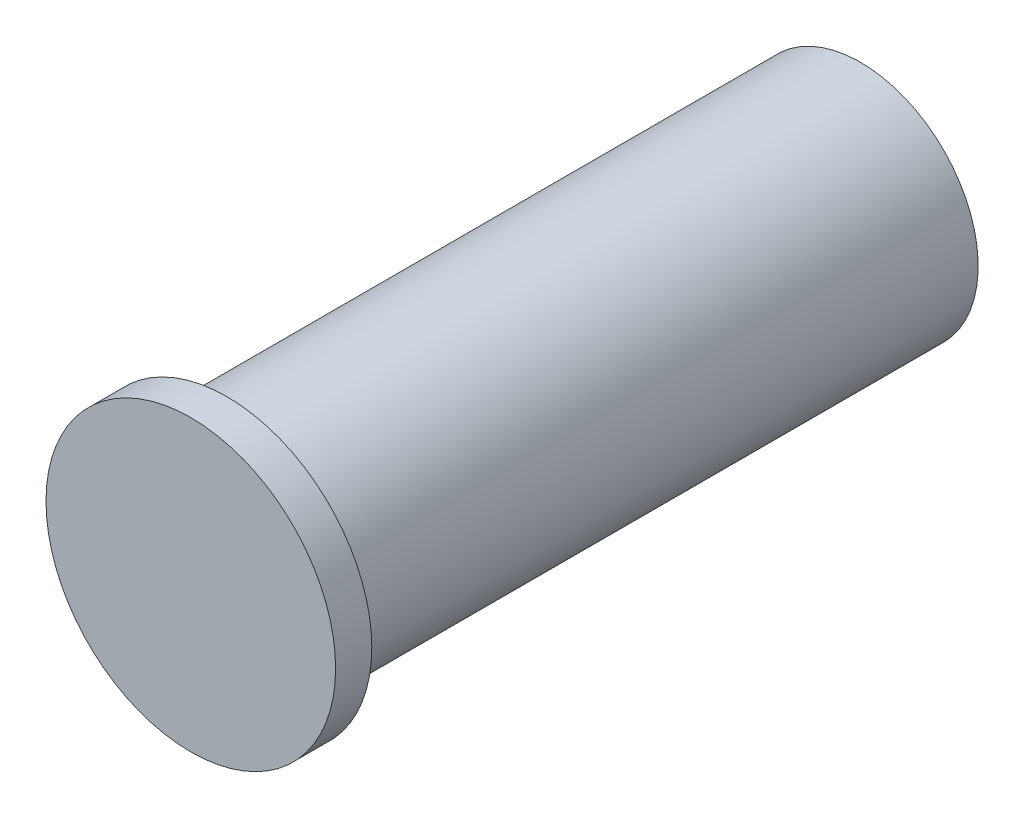
ISO-10303-21;
HEADER;
FILE_DESCRIPTION(('STEP AP214'),'2;1');
FILE_NAME('part.step','',(''),(''),'','','');
FILE_SCHEMA(('AUTOMOTIVE_DESIGN { 1 0 10303 214 1 1 1 1 }'));
ENDSEC;
DATA;
#1=APPLICATION_CONTEXT('core data for automotive mechanical design processes');
#2=APPLICATION_PROTOCOL_DEFINITION('international standard','automotive_design',2000,#1);
#3=PRODUCT_CONTEXT('',#1,'mechanical');
#4=PRODUCT('Part','Part','',(#3));
#5=PRODUCT_RELATED_PRODUCT_CATEGORY('part','',(#4));
#6=PRODUCT_DEFINITION_FORMATION('','',#4);
#7=PRODUCT_DEFINITION_CONTEXT('part definition',#1,'design');
#8=PRODUCT_DEFINITION('design','',#6,#7);
#9=PRODUCT_DEFINITION_SHAPE('','',#8);
#10=(LENGTH_UNIT() NAMED_UNIT(*) SI_UNIT(.MILLI.,.METRE.));
#11=(NAMED_UNIT(*) PLANE_ANGLE_UNIT() SI_UNIT($,.RADIAN.));
#12=(NAMED_UNIT(*) SI_UNIT($,.STERADIAN.) SOLID_ANGLE_UNIT());
#13=UNCERTAINTY_MEASURE_WITH_UNIT(LENGTH_MEASURE(1.E-05),#10,'distance_accuracy_value','');
#14=(GEOMETRIC_REPRESENTATION_CONTEXT(3) GLOBAL_UNCERTAINTY_ASSIGNED_CONTEXT((#13)) GLOBAL_UNIT_ASSIGNED_CONTEXT((#10,
#11,#12)) REPRESENTATION_CONTEXT('',''));
#15=CARTESIAN_POINT('',(0.,0.,0.));
#16=DIRECTION('',(0.,0.,1.));
#17=DIRECTION('',(1.,0.,0.));
#18=AXIS2_PLACEMENT_3D('',#15,#16,#17);
#19=CARTESIAN_POINT('',(0.,0.,0.4));
#20=DIRECTION('',(0.,0.,-1.));
#21=DIRECTION('',(-1.,0.,0.));
#22=AXIS2_PLACEMENT_3D('',#19,#20,#21);
#23=CYLINDRICAL_SURFACE('',#22,1.6);
#24=CARTESIAN_POINT('',(0.,0.,0.4));
#25=DIRECTION('',(0.,0.,1.));
#26=DIRECTION('',(1.,0.,0.));
#27=AXIS2_PLACEMENT_3D('',#24,#25,#26);
#28=CIRCLE('',#27,1.6);
#29=CARTESIAN_POINT('',(1.6,0.,0.4));
#30=VERTEX_POINT('',#29);
#31=EDGE_CURVE('E38',#30,#30,#28,.T.);
#32=ORIENTED_EDGE('',*,*,#31,.F.);
#33=EDGE_LOOP('',(#32));
#34=FACE_BOUND('',#33,.T.);
#35=CARTESIAN_POINT('',(0.,0.,0.));
#36=DIRECTION('',(0.,0.,1.));
#37=DIRECTION('',(1.,0.,0.));
#38=AXIS2_PLACEMENT_3D('',#35,#36,#37);
#39=CIRCLE('',#38,1.6);
#40=CARTESIAN_POINT('',(1.6,0.,0.));
#41=VERTEX_POINT('',#40);
#42=EDGE_CURVE('E34',#41,#41,#39,.T.);
#43=ORIENTED_EDGE('',*,*,#42,.T.);
#44=EDGE_LOOP('',(#43));
#45=FACE_BOUND('',#44,.T.);
#46=ADVANCED_FACE('F31',(#34,#45),#23,.T.);
#47=CARTESIAN_POINT('',(0.,0.,0.4));
#48=DIRECTION('',(0.,0.,1.));
#49=DIRECTION('',(1.,0.,0.));
#50=AXIS2_PLACEMENT_3D('',#47,#48,#49);
#51=PLANE('',#50);
#52=ORIENTED_EDGE('',*,*,#31,.T.);
#53=EDGE_LOOP('',(#52));
#54=FACE_BOUND('',#53,.T.);
#55=ADVANCED_FACE('F55',(#54),#51,.T.);
#56=CARTESIAN_POINT('',(0.,0.,0.));
#57=DIRECTION('',(0.,0.,1.));
#58=DIRECTION('',(1.,0.,0.));
#59=AXIS2_PLACEMENT_3D('',#56,#57,#58);
#60=PLANE('',#59);
#61=CARTESIAN_POINT('',(0.,0.,0.));
#62=DIRECTION('',(0.,0.,-1.));
#63=DIRECTION('',(-1.,0.,0.));
#64=AXIS2_PLACEMENT_3D('',#61,#62,#63);
#65=CIRCLE('',#64,1.3);
#66=CARTESIAN_POINT('',(-1.3,0.,0.));
#67=VERTEX_POINT('',#66);
#68=EDGE_CURVE('E10',#67,#67,#65,.T.);
#69=ORIENTED_EDGE('',*,*,#68,.F.);
#70=EDGE_LOOP('',(#69));
#71=FACE_BOUND('',#70,.T.);
#72=ORIENTED_EDGE('',*,*,#42,.F.);
#73=EDGE_LOOP('',(#72));
#74=FACE_BOUND('',#73,.T.);
#75=ADVANCED_FACE('F52',(#71,#74),#60,.F.);
#76=CARTESIAN_POINT('',(0.,0.,-7.));
#77=DIRECTION('',(0.,0.,1.));
#78=DIRECTION('',(1.,0.,0.));
#79=AXIS2_PLACEMENT_3D('',#76,#77,#78);
#80=CYLINDRICAL_SURFACE('',#79,1.3);
#81=CARTESIAN_POINT('',(0.,0.,-7.));
#82=DIRECTION('',(0.,0.,-1.));
#83=DIRECTION('',(-1.,0.,0.));
#84=AXIS2_PLACEMENT_3D('',#81,#82,#83);
#85=CIRCLE('',#84,1.3);
#86=CARTESIAN_POINT('',(-1.3,0.,-7.));
#87=VERTEX_POINT('',#86);
#88=EDGE_CURVE('E44',#87,#87,#85,.T.);
#89=ORIENTED_EDGE('',*,*,#88,.F.);
#90=EDGE_LOOP('',(#89));
#91=FACE_BOUND('',#90,.T.);
#92=ORIENTED_EDGE('',*,*,#68,.T.);
#93=EDGE_LOOP('',(#92));
#94=FACE_BOUND('',#93,.T.);
#95=ADVANCED_FACE('F54',(#91,#94),#80,.T.);
#96=CARTESIAN_POINT('',(0.,0.,-7.));
#97=DIRECTION('',(0.,0.,-1.));
#98=DIRECTION('',(-1.,0.,0.));
#99=AXIS2_PLACEMENT_3D('',#96,#97,#98);
#100=PLANE('',#99);
#101=ORIENTED_EDGE('',*,*,#88,.T.);
#102=EDGE_LOOP('',(#101));
#103=FACE_BOUND('',#102,.T.);
#104=ADVANCED_FACE('F61',(#103),#100,.T.);
#105=CLOSED_SHELL('',(#46,#55,#75,#95,#104));
#106=MANIFOLD_SOLID_BREP('B2',#105);
#107=ADVANCED_BREP_SHAPE_REPRESENTATION('',(#18,#106),#14);
#108=SHAPE_DEFINITION_REPRESENTATION(#9,#107);
ENDSEC;
END-ISO-10303-21;
